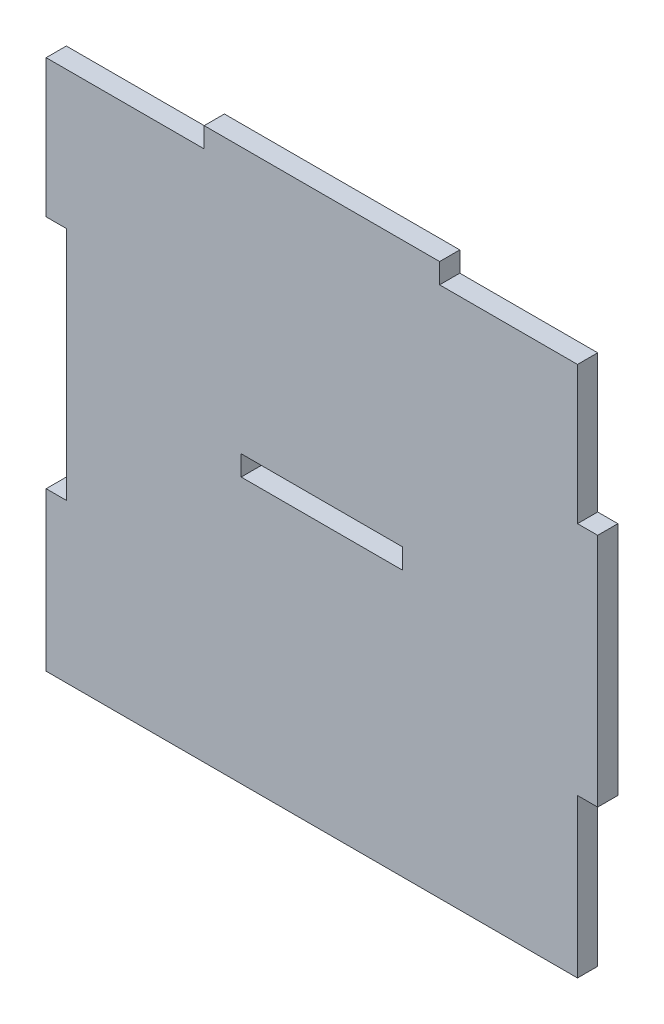
ISO-10303-21;
HEADER;
FILE_DESCRIPTION(('STEP AP214'),'2;1');
FILE_NAME('part.step','',(''),(''),'','','');
FILE_SCHEMA(('AUTOMOTIVE_DESIGN { 1 0 10303 214 1 1 1 1 }'));
ENDSEC;
DATA;
#1=APPLICATION_CONTEXT('core data for automotive mechanical design processes');
#2=APPLICATION_PROTOCOL_DEFINITION('international standard','automotive_design',2000,#1);
#3=PRODUCT_CONTEXT('',#1,'mechanical');
#4=PRODUCT('Part','Part','',(#3));
#5=PRODUCT_RELATED_PRODUCT_CATEGORY('part','',(#4));
#6=PRODUCT_DEFINITION_FORMATION('','',#4);
#7=PRODUCT_DEFINITION_CONTEXT('part definition',#1,'design');
#8=PRODUCT_DEFINITION('design','',#6,#7);
#9=PRODUCT_DEFINITION_SHAPE('','',#8);
#10=(LENGTH_UNIT() NAMED_UNIT(*) SI_UNIT(.MILLI.,.METRE.));
#11=(NAMED_UNIT(*) PLANE_ANGLE_UNIT() SI_UNIT($,.RADIAN.));
#12=(NAMED_UNIT(*) SI_UNIT($,.STERADIAN.) SOLID_ANGLE_UNIT());
#13=UNCERTAINTY_MEASURE_WITH_UNIT(LENGTH_MEASURE(1.E-05),#10,'distance_accuracy_value','');
#14=(GEOMETRIC_REPRESENTATION_CONTEXT(3) GLOBAL_UNCERTAINTY_ASSIGNED_CONTEXT((#13)) GLOBAL_UNIT_ASSIGNED_CONTEXT((#10,
#11,#12)) REPRESENTATION_CONTEXT('',''));
#15=CARTESIAN_POINT('',(0.,0.,0.));
#16=DIRECTION('',(0.,0.,1.));
#17=DIRECTION('',(1.,0.,0.));
#18=AXIS2_PLACEMENT_3D('',#15,#16,#17);
#19=CARTESIAN_POINT('',(38.,-16.,3.));
#20=DIRECTION('',(0.,1.,0.));
#21=DIRECTION('',(-1.,0.,0.));
#22=AXIS2_PLACEMENT_3D('',#19,#20,#21);
#23=PLANE('',#22);
#24=DIRECTION('',(1.,0.,0.));
#25=VECTOR('',#24,1.);
#26=CARTESIAN_POINT('',(38.,-16.,0.));
#27=LINE('',#26,#25);
#28=CARTESIAN_POINT('',(38.,-16.,0.));
#29=VERTEX_POINT('',#28);
#30=CARTESIAN_POINT('',(41.,-16.,0.));
#31=VERTEX_POINT('',#30);
#32=EDGE_CURVE('E218',#29,#31,#27,.T.);
#33=ORIENTED_EDGE('',*,*,#32,.T.);
#34=DIRECTION('',(0.,0.,-1.));
#35=VECTOR('',#34,1.);
#36=CARTESIAN_POINT('',(41.,-16.,3.));
#37=LINE('',#36,#35);
#38=CARTESIAN_POINT('',(41.,-16.,3.));
#39=VERTEX_POINT('',#38);
#40=EDGE_CURVE('E11',#39,#31,#37,.T.);
#41=ORIENTED_EDGE('',*,*,#40,.F.);
#42=DIRECTION('',(1.,0.,0.));
#43=VECTOR('',#42,1.);
#44=CARTESIAN_POINT('',(38.,-16.,3.));
#45=LINE('',#44,#43);
#46=CARTESIAN_POINT('',(38.,-16.,3.));
#47=VERTEX_POINT('',#46);
#48=EDGE_CURVE('E224',#47,#39,#45,.T.);
#49=ORIENTED_EDGE('',*,*,#48,.F.);
#50=DIRECTION('',(0.,0.,-1.));
#51=VECTOR('',#50,1.);
#52=CARTESIAN_POINT('',(38.,-16.,3.));
#53=LINE('',#52,#51);
#54=EDGE_CURVE('E274',#47,#29,#53,.T.);
#55=ORIENTED_EDGE('',*,*,#54,.T.);
#56=EDGE_LOOP('',(#33,#41,#49,#55));
#57=FACE_BOUND('',#56,.T.);
#58=ADVANCED_FACE('F38',(#57),#23,.F.);
#59=CARTESIAN_POINT('',(41.,16.,3.));
#60=DIRECTION('',(-1.,0.,0.));
#61=DIRECTION('',(0.,0.,1.));
#62=AXIS2_PLACEMENT_3D('',#59,#60,#61);
#63=PLANE('',#62);
#64=DIRECTION('',(0.,1.,0.));
#65=VECTOR('',#64,1.);
#66=CARTESIAN_POINT('',(41.,16.,0.));
#67=LINE('',#66,#65);
#68=CARTESIAN_POINT('',(41.,19.,0.));
#69=VERTEX_POINT('',#68);
#70=EDGE_CURVE('E278',#31,#69,#67,.T.);
#71=ORIENTED_EDGE('',*,*,#70,.T.);
#72=DIRECTION('',(0.,0.,-1.));
#73=VECTOR('',#72,1.);
#74=CARTESIAN_POINT('',(41.,19.,3.));
#75=LINE('',#74,#73);
#76=CARTESIAN_POINT('',(41.,19.,3.));
#77=VERTEX_POINT('',#76);
#78=EDGE_CURVE('E46',#77,#69,#75,.T.);
#79=ORIENTED_EDGE('',*,*,#78,.F.);
#80=DIRECTION('',(0.,1.,0.));
#81=VECTOR('',#80,1.);
#82=CARTESIAN_POINT('',(41.,16.,3.));
#83=LINE('',#82,#81);
#84=EDGE_CURVE('E228',#39,#77,#83,.T.);
#85=ORIENTED_EDGE('',*,*,#84,.F.);
#86=ORIENTED_EDGE('',*,*,#40,.T.);
#87=EDGE_LOOP('',(#71,#79,#85,#86));
#88=FACE_BOUND('',#87,.T.);
#89=ADVANCED_FACE('F407',(#88),#63,.F.);
#90=CARTESIAN_POINT('',(41.,19.,3.));
#91=DIRECTION('',(0.,-1.,0.));
#92=DIRECTION('',(0.,0.,-1.));
#93=AXIS2_PLACEMENT_3D('',#90,#91,#92);
#94=PLANE('',#93);
#95=DIRECTION('',(-1.,0.,0.));
#96=VECTOR('',#95,1.);
#97=CARTESIAN_POINT('',(41.,19.,0.));
#98=LINE('',#97,#96);
#99=CARTESIAN_POINT('',(38.,19.,0.));
#100=VERTEX_POINT('',#99);
#101=EDGE_CURVE('E281',#69,#100,#98,.T.);
#102=ORIENTED_EDGE('',*,*,#101,.T.);
#103=DIRECTION('',(0.,0.,-1.));
#104=VECTOR('',#103,1.);
#105=CARTESIAN_POINT('',(38.,19.,3.));
#106=LINE('',#105,#104);
#107=CARTESIAN_POINT('',(38.,19.,3.));
#108=VERTEX_POINT('',#107);
#109=EDGE_CURVE('E377',#108,#100,#106,.T.);
#110=ORIENTED_EDGE('',*,*,#109,.F.);
#111=DIRECTION('',(-1.,0.,0.));
#112=VECTOR('',#111,1.);
#113=CARTESIAN_POINT('',(41.,19.,3.));
#114=LINE('',#113,#112);
#115=EDGE_CURVE('E232',#77,#108,#114,.T.);
#116=ORIENTED_EDGE('',*,*,#115,.F.);
#117=ORIENTED_EDGE('',*,*,#78,.T.);
#118=EDGE_LOOP('',(#102,#110,#116,#117));
#119=FACE_BOUND('',#118,.T.);
#120=ADVANCED_FACE('F386',(#119),#94,.F.);
#121=CARTESIAN_POINT('',(38.,39.5,3.));
#122=DIRECTION('',(-1.,0.,0.));
#123=DIRECTION('',(0.,-1.,0.));
#124=AXIS2_PLACEMENT_3D('',#121,#122,#123);
#125=PLANE('',#124);
#126=DIRECTION('',(0.,1.,0.));
#127=VECTOR('',#126,1.);
#128=CARTESIAN_POINT('',(38.,39.5,0.));
#129=LINE('',#128,#127);
#130=CARTESIAN_POINT('',(38.,39.5,0.));
#131=VERTEX_POINT('',#130);
#132=EDGE_CURVE('E284',#100,#131,#129,.T.);
#133=ORIENTED_EDGE('',*,*,#132,.T.);
#134=DIRECTION('',(0.,0.,-1.));
#135=VECTOR('',#134,1.);
#136=CARTESIAN_POINT('',(38.,39.5,3.));
#137=LINE('',#136,#135);
#138=CARTESIAN_POINT('',(38.,39.5,3.));
#139=VERTEX_POINT('',#138);
#140=EDGE_CURVE('E373',#139,#131,#137,.T.);
#141=ORIENTED_EDGE('',*,*,#140,.F.);
#142=DIRECTION('',(0.,1.,0.));
#143=VECTOR('',#142,1.);
#144=CARTESIAN_POINT('',(38.,39.5,3.));
#145=LINE('',#144,#143);
#146=EDGE_CURVE('E235',#108,#139,#145,.T.);
#147=ORIENTED_EDGE('',*,*,#146,.F.);
#148=ORIENTED_EDGE('',*,*,#109,.T.);
#149=EDGE_LOOP('',(#133,#141,#147,#148));
#150=FACE_BOUND('',#149,.T.);
#151=ADVANCED_FACE('F395',(#150),#125,.F.);
#152=CARTESIAN_POINT('',(17.5,39.5,3.));
#153=DIRECTION('',(0.,-1.,0.));
#154=DIRECTION('',(1.,0.,0.));
#155=AXIS2_PLACEMENT_3D('',#152,#153,#154);
#156=PLANE('',#155);
#157=DIRECTION('',(-1.,0.,0.));
#158=VECTOR('',#157,1.);
#159=CARTESIAN_POINT('',(17.5,39.5,0.));
#160=LINE('',#159,#158);
#161=CARTESIAN_POINT('',(17.5,39.5,0.));
#162=VERTEX_POINT('',#161);
#163=EDGE_CURVE('E287',#131,#162,#160,.T.);
#164=ORIENTED_EDGE('',*,*,#163,.T.);
#165=DIRECTION('',(0.,0.,-1.));
#166=VECTOR('',#165,1.);
#167=CARTESIAN_POINT('',(17.5,39.5,3.));
#168=LINE('',#167,#166);
#169=CARTESIAN_POINT('',(17.5,39.5,3.));
#170=VERTEX_POINT('',#169);
#171=EDGE_CURVE('E369',#170,#162,#168,.T.);
#172=ORIENTED_EDGE('',*,*,#171,.F.);
#173=DIRECTION('',(-1.,0.,0.));
#174=VECTOR('',#173,1.);
#175=CARTESIAN_POINT('',(17.5,39.5,3.));
#176=LINE('',#175,#174);
#177=EDGE_CURVE('E238',#139,#170,#176,.T.);
#178=ORIENTED_EDGE('',*,*,#177,.F.);
#179=ORIENTED_EDGE('',*,*,#140,.T.);
#180=EDGE_LOOP('',(#164,#172,#178,#179));
#181=FACE_BOUND('',#180,.T.);
#182=ADVANCED_FACE('F399',(#181),#156,.F.);
#183=CARTESIAN_POINT('',(17.5,42.5,3.));
#184=DIRECTION('',(-1.,0.,0.));
#185=DIRECTION('',(0.,-1.,0.));
#186=AXIS2_PLACEMENT_3D('',#183,#184,#185);
#187=PLANE('',#186);
#188=DIRECTION('',(0.,1.,0.));
#189=VECTOR('',#188,1.);
#190=CARTESIAN_POINT('',(17.5,42.5,0.));
#191=LINE('',#190,#189);
#192=CARTESIAN_POINT('',(17.5,42.5,0.));
#193=VERTEX_POINT('',#192);
#194=EDGE_CURVE('E290',#162,#193,#191,.T.);
#195=ORIENTED_EDGE('',*,*,#194,.T.);
#196=DIRECTION('',(0.,0.,-1.));
#197=VECTOR('',#196,1.);
#198=CARTESIAN_POINT('',(17.5,42.5,3.));
#199=LINE('',#198,#197);
#200=CARTESIAN_POINT('',(17.5,42.5,3.));
#201=VERTEX_POINT('',#200);
#202=EDGE_CURVE('E365',#201,#193,#199,.T.);
#203=ORIENTED_EDGE('',*,*,#202,.F.);
#204=DIRECTION('',(0.,1.,0.));
#205=VECTOR('',#204,1.);
#206=CARTESIAN_POINT('',(17.5,42.5,3.));
#207=LINE('',#206,#205);
#208=EDGE_CURVE('E241',#170,#201,#207,.T.);
#209=ORIENTED_EDGE('',*,*,#208,.F.);
#210=ORIENTED_EDGE('',*,*,#171,.T.);
#211=EDGE_LOOP('',(#195,#203,#209,#210));
#212=FACE_BOUND('',#211,.T.);
#213=ADVANCED_FACE('F456',(#212),#187,.F.);
#214=CARTESIAN_POINT('',(-17.5,42.5,3.));
#215=DIRECTION('',(0.,-1.,0.));
#216=DIRECTION('',(0.,0.,-1.));
#217=AXIS2_PLACEMENT_3D('',#214,#215,#216);
#218=PLANE('',#217);
#219=DIRECTION('',(-1.,0.,0.));
#220=VECTOR('',#219,1.);
#221=CARTESIAN_POINT('',(-17.5,42.5,0.));
#222=LINE('',#221,#220);
#223=CARTESIAN_POINT('',(-17.5,42.5,0.));
#224=VERTEX_POINT('',#223);
#225=EDGE_CURVE('E293',#193,#224,#222,.T.);
#226=ORIENTED_EDGE('',*,*,#225,.T.);
#227=DIRECTION('',(0.,0.,-1.));
#228=VECTOR('',#227,1.);
#229=CARTESIAN_POINT('',(-17.5,42.5,3.));
#230=LINE('',#229,#228);
#231=CARTESIAN_POINT('',(-17.5,42.5,3.));
#232=VERTEX_POINT('',#231);
#233=EDGE_CURVE('E361',#232,#224,#230,.T.);
#234=ORIENTED_EDGE('',*,*,#233,.F.);
#235=DIRECTION('',(-1.,0.,0.));
#236=VECTOR('',#235,1.);
#237=CARTESIAN_POINT('',(-17.5,42.5,3.));
#238=LINE('',#237,#236);
#239=EDGE_CURVE('E244',#201,#232,#238,.T.);
#240=ORIENTED_EDGE('',*,*,#239,.F.);
#241=ORIENTED_EDGE('',*,*,#202,.T.);
#242=EDGE_LOOP('',(#226,#234,#240,#241));
#243=FACE_BOUND('',#242,.T.);
#244=ADVANCED_FACE('F454',(#243),#218,.F.);
#245=CARTESIAN_POINT('',(-17.5,39.5,3.));
#246=DIRECTION('',(1.,0.,0.));
#247=DIRECTION('',(0.,0.,-1.));
#248=AXIS2_PLACEMENT_3D('',#245,#246,#247);
#249=PLANE('',#248);
#250=DIRECTION('',(0.,-1.,0.));
#251=VECTOR('',#250,1.);
#252=CARTESIAN_POINT('',(-17.5,39.5,0.));
#253=LINE('',#252,#251);
#254=CARTESIAN_POINT('',(-17.5,39.5,0.));
#255=VERTEX_POINT('',#254);
#256=EDGE_CURVE('E296',#224,#255,#253,.T.);
#257=ORIENTED_EDGE('',*,*,#256,.T.);
#258=DIRECTION('',(0.,0.,-1.));
#259=VECTOR('',#258,1.);
#260=CARTESIAN_POINT('',(-17.5,39.5,3.));
#261=LINE('',#260,#259);
#262=CARTESIAN_POINT('',(-17.5,39.5,3.));
#263=VERTEX_POINT('',#262);
#264=EDGE_CURVE('E357',#263,#255,#261,.T.);
#265=ORIENTED_EDGE('',*,*,#264,.F.);
#266=DIRECTION('',(0.,-1.,0.));
#267=VECTOR('',#266,1.);
#268=CARTESIAN_POINT('',(-17.5,39.5,3.));
#269=LINE('',#268,#267);
#270=EDGE_CURVE('E247',#232,#263,#269,.T.);
#271=ORIENTED_EDGE('',*,*,#270,.F.);
#272=ORIENTED_EDGE('',*,*,#233,.T.);
#273=EDGE_LOOP('',(#257,#265,#271,#272));
#274=FACE_BOUND('',#273,.T.);
#275=ADVANCED_FACE('F447',(#274),#249,.F.);
#276=CARTESIAN_POINT('',(-41.,39.5,3.));
#277=DIRECTION('',(0.,-1.,0.));
#278=DIRECTION('',(0.,0.,-1.));
#279=AXIS2_PLACEMENT_3D('',#276,#277,#278);
#280=PLANE('',#279);
#281=DIRECTION('',(-1.,0.,0.));
#282=VECTOR('',#281,1.);
#283=CARTESIAN_POINT('',(-41.,39.5,0.));
#284=LINE('',#283,#282);
#285=CARTESIAN_POINT('',(-41.,39.5,0.));
#286=VERTEX_POINT('',#285);
#287=EDGE_CURVE('E300',#255,#286,#284,.T.);
#288=ORIENTED_EDGE('',*,*,#287,.T.);
#289=DIRECTION('',(0.,0.,-1.));
#290=VECTOR('',#289,1.);
#291=CARTESIAN_POINT('',(-41.,39.5,3.));
#292=LINE('',#291,#290);
#293=CARTESIAN_POINT('',(-41.,39.5,3.));
#294=VERTEX_POINT('',#293);
#295=EDGE_CURVE('E353',#294,#286,#292,.T.);
#296=ORIENTED_EDGE('',*,*,#295,.F.);
#297=DIRECTION('',(-1.,0.,0.));
#298=VECTOR('',#297,1.);
#299=CARTESIAN_POINT('',(-38.,39.5,3.));
#300=LINE('',#299,#298);
#301=EDGE_CURVE('E250',#263,#294,#300,.T.);
#302=ORIENTED_EDGE('',*,*,#301,.F.);
#303=ORIENTED_EDGE('',*,*,#264,.T.);
#304=EDGE_LOOP('',(#288,#296,#302,#303));
#305=FACE_BOUND('',#304,.T.);
#306=ADVANCED_FACE('F451',(#305),#280,.F.);
#307=CARTESIAN_POINT('',(-41.,19.,3.));
#308=DIRECTION('',(1.,0.,0.));
#309=DIRECTION('',(0.,1.,0.));
#310=AXIS2_PLACEMENT_3D('',#307,#308,#309);
#311=PLANE('',#310);
#312=DIRECTION('',(0.,-1.,0.));
#313=VECTOR('',#312,1.);
#314=CARTESIAN_POINT('',(-41.,19.,0.));
#315=LINE('',#314,#313);
#316=CARTESIAN_POINT('',(-41.,19.,0.));
#317=VERTEX_POINT('',#316);
#318=EDGE_CURVE('E303',#286,#317,#315,.T.);
#319=ORIENTED_EDGE('',*,*,#318,.T.);
#320=DIRECTION('',(0.,0.,-1.));
#321=VECTOR('',#320,1.);
#322=CARTESIAN_POINT('',(-41.,19.,3.));
#323=LINE('',#322,#321);
#324=CARTESIAN_POINT('',(-41.,19.,3.));
#325=VERTEX_POINT('',#324);
#326=EDGE_CURVE('E349',#325,#317,#323,.T.);
#327=ORIENTED_EDGE('',*,*,#326,.F.);
#328=DIRECTION('',(0.,-1.,0.));
#329=VECTOR('',#328,1.);
#330=CARTESIAN_POINT('',(-41.,19.,3.));
#331=LINE('',#330,#329);
#332=EDGE_CURVE('E253',#294,#325,#331,.T.);
#333=ORIENTED_EDGE('',*,*,#332,.F.);
#334=ORIENTED_EDGE('',*,*,#295,.T.);
#335=EDGE_LOOP('',(#319,#327,#333,#334));
#336=FACE_BOUND('',#335,.T.);
#337=ADVANCED_FACE('F440',(#336),#311,.F.);
#338=CARTESIAN_POINT('',(-38.,19.,3.));
#339=DIRECTION('',(0.,1.,0.));
#340=DIRECTION('',(-1.,0.,0.));
#341=AXIS2_PLACEMENT_3D('',#338,#339,#340);
#342=PLANE('',#341);
#343=DIRECTION('',(1.,0.,0.));
#344=VECTOR('',#343,1.);
#345=CARTESIAN_POINT('',(-38.,19.,0.));
#346=LINE('',#345,#344);
#347=CARTESIAN_POINT('',(-38.,19.,0.));
#348=VERTEX_POINT('',#347);
#349=EDGE_CURVE('E306',#317,#348,#346,.T.);
#350=ORIENTED_EDGE('',*,*,#349,.T.);
#351=DIRECTION('',(0.,0.,-1.));
#352=VECTOR('',#351,1.);
#353=CARTESIAN_POINT('',(-38.,19.,3.));
#354=LINE('',#353,#352);
#355=CARTESIAN_POINT('',(-38.,19.,3.));
#356=VERTEX_POINT('',#355);
#357=EDGE_CURVE('E345',#356,#348,#354,.T.);
#358=ORIENTED_EDGE('',*,*,#357,.F.);
#359=DIRECTION('',(1.,0.,0.));
#360=VECTOR('',#359,1.);
#361=CARTESIAN_POINT('',(-38.,19.,3.));
#362=LINE('',#361,#360);
#363=EDGE_CURVE('E256',#325,#356,#362,.T.);
#364=ORIENTED_EDGE('',*,*,#363,.F.);
#365=ORIENTED_EDGE('',*,*,#326,.T.);
#366=EDGE_LOOP('',(#350,#358,#364,#365));
#367=FACE_BOUND('',#366,.T.);
#368=ADVANCED_FACE('F435',(#367),#342,.F.);
#369=CARTESIAN_POINT('',(-38.,16.,3.));
#370=DIRECTION('',(1.,0.,0.));
#371=DIRECTION('',(0.,0.,-1.));
#372=AXIS2_PLACEMENT_3D('',#369,#370,#371);
#373=PLANE('',#372);
#374=DIRECTION('',(0.,-1.,0.));
#375=VECTOR('',#374,1.);
#376=CARTESIAN_POINT('',(-38.,16.,0.));
#377=LINE('',#376,#375);
#378=CARTESIAN_POINT('',(-38.,-16.,0.));
#379=VERTEX_POINT('',#378);
#380=EDGE_CURVE('E310',#348,#379,#377,.T.);
#381=ORIENTED_EDGE('',*,*,#380,.T.);
#382=DIRECTION('',(0.,0.,-1.));
#383=VECTOR('',#382,1.);
#384=CARTESIAN_POINT('',(-38.,-16.,3.));
#385=LINE('',#384,#383);
#386=CARTESIAN_POINT('',(-38.,-16.,3.));
#387=VERTEX_POINT('',#386);
#388=EDGE_CURVE('E341',#387,#379,#385,.T.);
#389=ORIENTED_EDGE('',*,*,#388,.F.);
#390=DIRECTION('',(0.,-1.,0.));
#391=VECTOR('',#390,1.);
#392=CARTESIAN_POINT('',(-38.,16.,3.));
#393=LINE('',#392,#391);
#394=EDGE_CURVE('E259',#356,#387,#393,.T.);
#395=ORIENTED_EDGE('',*,*,#394,.F.);
#396=ORIENTED_EDGE('',*,*,#357,.T.);
#397=EDGE_LOOP('',(#381,#389,#395,#396));
#398=FACE_BOUND('',#397,.T.);
#399=ADVANCED_FACE('F430',(#398),#373,.F.);
#400=CARTESIAN_POINT('',(-41.,-16.,3.));
#401=DIRECTION('',(0.,-1.,0.));
#402=DIRECTION('',(0.,0.,-1.));
#403=AXIS2_PLACEMENT_3D('',#400,#401,#402);
#404=PLANE('',#403);
#405=DIRECTION('',(-1.,0.,0.));
#406=VECTOR('',#405,1.);
#407=CARTESIAN_POINT('',(-41.,-16.,0.));
#408=LINE('',#407,#406);
#409=CARTESIAN_POINT('',(-41.,-16.,0.));
#410=VERTEX_POINT('',#409);
#411=EDGE_CURVE('E313',#379,#410,#408,.T.);
#412=ORIENTED_EDGE('',*,*,#411,.T.);
#413=DIRECTION('',(0.,0.,-1.));
#414=VECTOR('',#413,1.);
#415=CARTESIAN_POINT('',(-41.,-16.,3.));
#416=LINE('',#415,#414);
#417=CARTESIAN_POINT('',(-41.,-16.,3.));
#418=VERTEX_POINT('',#417);
#419=EDGE_CURVE('E337',#418,#410,#416,.T.);
#420=ORIENTED_EDGE('',*,*,#419,.F.);
#421=DIRECTION('',(-1.,0.,0.));
#422=VECTOR('',#421,1.);
#423=CARTESIAN_POINT('',(-41.,-16.,3.));
#424=LINE('',#423,#422);
#425=EDGE_CURVE('E262',#387,#418,#424,.T.);
#426=ORIENTED_EDGE('',*,*,#425,.F.);
#427=ORIENTED_EDGE('',*,*,#388,.T.);
#428=EDGE_LOOP('',(#412,#420,#426,#427));
#429=FACE_BOUND('',#428,.T.);
#430=ADVANCED_FACE('F426',(#429),#404,.F.);
#431=CARTESIAN_POINT('',(-41.,-19.,3.));
#432=DIRECTION('',(1.,0.,0.));
#433=DIRECTION('',(0.,1.,0.));
#434=AXIS2_PLACEMENT_3D('',#431,#432,#433);
#435=PLANE('',#434);
#436=DIRECTION('',(0.,-1.,0.));
#437=VECTOR('',#436,1.);
#438=CARTESIAN_POINT('',(-41.,-19.,0.));
#439=LINE('',#438,#437);
#440=CARTESIAN_POINT('',(-41.,-39.5,0.));
#441=VERTEX_POINT('',#440);
#442=EDGE_CURVE('E317',#410,#441,#439,.T.);
#443=ORIENTED_EDGE('',*,*,#442,.T.);
#444=DIRECTION('',(0.,0.,-1.));
#445=VECTOR('',#444,1.);
#446=CARTESIAN_POINT('',(-41.,-39.5,3.));
#447=LINE('',#446,#445);
#448=CARTESIAN_POINT('',(-41.,-39.5,3.));
#449=VERTEX_POINT('',#448);
#450=EDGE_CURVE('E333',#449,#441,#447,.T.);
#451=ORIENTED_EDGE('',*,*,#450,.F.);
#452=DIRECTION('',(0.,-1.,0.));
#453=VECTOR('',#452,1.);
#454=CARTESIAN_POINT('',(-41.,-19.,3.));
#455=LINE('',#454,#453);
#456=EDGE_CURVE('E265',#418,#449,#455,.T.);
#457=ORIENTED_EDGE('',*,*,#456,.F.);
#458=ORIENTED_EDGE('',*,*,#419,.T.);
#459=EDGE_LOOP('',(#443,#451,#457,#458));
#460=FACE_BOUND('',#459,.T.);
#461=ADVANCED_FACE('F423',(#460),#435,.F.);
#462=CARTESIAN_POINT('',(-41.,-39.5,3.));
#463=DIRECTION('',(0.,1.,0.));
#464=DIRECTION('',(0.,0.,1.));
#465=AXIS2_PLACEMENT_3D('',#462,#463,#464);
#466=PLANE('',#465);
#467=DIRECTION('',(1.,0.,0.));
#468=VECTOR('',#467,1.);
#469=CARTESIAN_POINT('',(-41.,-39.5,0.));
#470=LINE('',#469,#468);
#471=CARTESIAN_POINT('',(38.,-39.5,0.));
#472=VERTEX_POINT('',#471);
#473=EDGE_CURVE('E320',#441,#472,#470,.T.);
#474=ORIENTED_EDGE('',*,*,#473,.T.);
#475=DIRECTION('',(0.,0.,-1.));
#476=VECTOR('',#475,1.);
#477=CARTESIAN_POINT('',(38.,-39.5,3.));
#478=LINE('',#477,#476);
#479=CARTESIAN_POINT('',(38.,-39.5,3.));
#480=VERTEX_POINT('',#479);
#481=EDGE_CURVE('E329',#480,#472,#478,.T.);
#482=ORIENTED_EDGE('',*,*,#481,.F.);
#483=DIRECTION('',(1.,0.,0.));
#484=VECTOR('',#483,1.);
#485=CARTESIAN_POINT('',(-41.,-39.5,3.));
#486=LINE('',#485,#484);
#487=EDGE_CURVE('E268',#449,#480,#486,.T.);
#488=ORIENTED_EDGE('',*,*,#487,.F.);
#489=ORIENTED_EDGE('',*,*,#450,.T.);
#490=EDGE_LOOP('',(#474,#482,#488,#489));
#491=FACE_BOUND('',#490,.T.);
#492=ADVANCED_FACE('F414',(#491),#466,.F.);
#493=CARTESIAN_POINT('',(38.,-19.,3.));
#494=DIRECTION('',(-1.,0.,0.));
#495=DIRECTION('',(0.,-1.,0.));
#496=AXIS2_PLACEMENT_3D('',#493,#494,#495);
#497=PLANE('',#496);
#498=DIRECTION('',(0.,1.,0.));
#499=VECTOR('',#498,1.);
#500=CARTESIAN_POINT('',(38.,-19.,0.));
#501=LINE('',#500,#499);
#502=EDGE_CURVE('E229',#472,#29,#501,.T.);
#503=ORIENTED_EDGE('',*,*,#502,.T.);
#504=ORIENTED_EDGE('',*,*,#54,.F.);
#505=DIRECTION('',(0.,1.,0.));
#506=VECTOR('',#505,1.);
#507=CARTESIAN_POINT('',(38.,-19.,3.));
#508=LINE('',#507,#506);
#509=EDGE_CURVE('E271',#480,#47,#508,.T.);
#510=ORIENTED_EDGE('',*,*,#509,.F.);
#511=ORIENTED_EDGE('',*,*,#481,.T.);
#512=EDGE_LOOP('',(#503,#504,#510,#511));
#513=FACE_BOUND('',#512,.T.);
#514=ADVANCED_FACE('F418',(#513),#497,.F.);
#515=CARTESIAN_POINT('',(0.,0.,3.));
#516=DIRECTION('',(0.,0.,-1.));
#517=DIRECTION('',(-1.,0.,0.));
#518=AXIS2_PLACEMENT_3D('',#515,#516,#517);
#519=PLANE('',#518);
#520=DIRECTION('',(-1.,0.,0.));
#521=VECTOR('',#520,1.);
#522=CARTESIAN_POINT('',(-12.,3.,3.));
#523=LINE('',#522,#521);
#524=CARTESIAN_POINT('',(12.,3.,3.));
#525=VERTEX_POINT('',#524);
#526=CARTESIAN_POINT('',(-12.,3.,3.));
#527=VERTEX_POINT('',#526);
#528=EDGE_CURVE('E209',#525,#527,#523,.T.);
#529=ORIENTED_EDGE('',*,*,#528,.F.);
#530=DIRECTION('',(0.,1.,0.));
#531=VECTOR('',#530,1.);
#532=CARTESIAN_POINT('',(12.,3.,3.));
#533=LINE('',#532,#531);
#534=CARTESIAN_POINT('',(12.,0.,3.));
#535=VERTEX_POINT('',#534);
#536=EDGE_CURVE('E53',#535,#525,#533,.T.);
#537=ORIENTED_EDGE('',*,*,#536,.F.);
#538=DIRECTION('',(1.,0.,0.));
#539=VECTOR('',#538,1.);
#540=CARTESIAN_POINT('',(-12.,0.,3.));
#541=LINE('',#540,#539);
#542=CARTESIAN_POINT('',(-12.,0.,3.));
#543=VERTEX_POINT('',#542);
#544=EDGE_CURVE('E196',#543,#535,#541,.T.);
#545=ORIENTED_EDGE('',*,*,#544,.F.);
#546=DIRECTION('',(0.,-1.,0.));
#547=VECTOR('',#546,1.);
#548=CARTESIAN_POINT('',(-12.,3.,3.));
#549=LINE('',#548,#547);
#550=EDGE_CURVE('E200',#527,#543,#549,.T.);
#551=ORIENTED_EDGE('',*,*,#550,.F.);
#552=EDGE_LOOP('',(#529,#537,#545,#551));
#553=FACE_BOUND('',#552,.T.);
#554=ORIENTED_EDGE('',*,*,#48,.T.);
#555=ORIENTED_EDGE('',*,*,#84,.T.);
#556=ORIENTED_EDGE('',*,*,#115,.T.);
#557=ORIENTED_EDGE('',*,*,#146,.T.);
#558=ORIENTED_EDGE('',*,*,#177,.T.);
#559=ORIENTED_EDGE('',*,*,#208,.T.);
#560=ORIENTED_EDGE('',*,*,#239,.T.);
#561=ORIENTED_EDGE('',*,*,#270,.T.);
#562=ORIENTED_EDGE('',*,*,#301,.T.);
#563=ORIENTED_EDGE('',*,*,#332,.T.);
#564=ORIENTED_EDGE('',*,*,#363,.T.);
#565=ORIENTED_EDGE('',*,*,#394,.T.);
#566=ORIENTED_EDGE('',*,*,#425,.T.);
#567=ORIENTED_EDGE('',*,*,#456,.T.);
#568=ORIENTED_EDGE('',*,*,#487,.T.);
#569=ORIENTED_EDGE('',*,*,#509,.T.);
#570=EDGE_LOOP('',(#554,#555,#556,#557,#558,#559,#560,#561,#562,#563,#564,#565,#566,#567,#568,#569));
#571=FACE_BOUND('',#570,.T.);
#572=ADVANCED_FACE('F403',(#553,#571),#519,.F.);
#573=CARTESIAN_POINT('',(0.,0.,0.));
#574=DIRECTION('',(0.,0.,-1.));
#575=DIRECTION('',(-1.,0.,0.));
#576=AXIS2_PLACEMENT_3D('',#573,#574,#575);
#577=PLANE('',#576);
#578=DIRECTION('',(0.,1.,0.));
#579=VECTOR('',#578,1.);
#580=CARTESIAN_POINT('',(12.,3.,0.));
#581=LINE('',#580,#579);
#582=CARTESIAN_POINT('',(12.,0.,0.));
#583=VERTEX_POINT('',#582);
#584=CARTESIAN_POINT('',(12.,3.,0.));
#585=VERTEX_POINT('',#584);
#586=EDGE_CURVE('E177',#583,#585,#581,.T.);
#587=ORIENTED_EDGE('',*,*,#586,.T.);
#588=DIRECTION('',(-1.,0.,0.));
#589=VECTOR('',#588,1.);
#590=CARTESIAN_POINT('',(-12.,3.,0.));
#591=LINE('',#590,#589);
#592=CARTESIAN_POINT('',(-12.,3.,0.));
#593=VERTEX_POINT('',#592);
#594=EDGE_CURVE('E187',#585,#593,#591,.T.);
#595=ORIENTED_EDGE('',*,*,#594,.T.);
#596=DIRECTION('',(0.,-1.,0.));
#597=VECTOR('',#596,1.);
#598=CARTESIAN_POINT('',(-12.,3.,0.));
#599=LINE('',#598,#597);
#600=CARTESIAN_POINT('',(-12.,0.,0.));
#601=VERTEX_POINT('',#600);
#602=EDGE_CURVE('E61',#593,#601,#599,.T.);
#603=ORIENTED_EDGE('',*,*,#602,.T.);
#604=DIRECTION('',(1.,0.,0.));
#605=VECTOR('',#604,1.);
#606=CARTESIAN_POINT('',(-12.,0.,0.));
#607=LINE('',#606,#605);
#608=EDGE_CURVE('E184',#601,#583,#607,.T.);
#609=ORIENTED_EDGE('',*,*,#608,.T.);
#610=EDGE_LOOP('',(#587,#595,#603,#609));
#611=FACE_BOUND('',#610,.T.);
#612=ORIENTED_EDGE('',*,*,#32,.F.);
#613=ORIENTED_EDGE('',*,*,#502,.F.);
#614=ORIENTED_EDGE('',*,*,#473,.F.);
#615=ORIENTED_EDGE('',*,*,#442,.F.);
#616=ORIENTED_EDGE('',*,*,#411,.F.);
#617=ORIENTED_EDGE('',*,*,#380,.F.);
#618=ORIENTED_EDGE('',*,*,#349,.F.);
#619=ORIENTED_EDGE('',*,*,#318,.F.);
#620=ORIENTED_EDGE('',*,*,#287,.F.);
#621=ORIENTED_EDGE('',*,*,#256,.F.);
#622=ORIENTED_EDGE('',*,*,#225,.F.);
#623=ORIENTED_EDGE('',*,*,#194,.F.);
#624=ORIENTED_EDGE('',*,*,#163,.F.);
#625=ORIENTED_EDGE('',*,*,#132,.F.);
#626=ORIENTED_EDGE('',*,*,#101,.F.);
#627=ORIENTED_EDGE('',*,*,#70,.F.);
#628=EDGE_LOOP('',(#612,#613,#614,#615,#616,#617,#618,#619,#620,#621,#622,#623,#624,#625,#626,#627));
#629=FACE_BOUND('',#628,.T.);
#630=ADVANCED_FACE('F192',(#611,#629),#577,.T.);
#631=CARTESIAN_POINT('',(12.,3.,0.));
#632=DIRECTION('',(1.,0.,0.));
#633=DIRECTION('',(0.,1.,0.));
#634=AXIS2_PLACEMENT_3D('',#631,#632,#633);
#635=PLANE('',#634);
#636=ORIENTED_EDGE('',*,*,#536,.T.);
#637=DIRECTION('',(0.,0.,1.));
#638=VECTOR('',#637,1.);
#639=CARTESIAN_POINT('',(12.,3.,0.));
#640=LINE('',#639,#638);
#641=EDGE_CURVE('E173',#585,#525,#640,.T.);
#642=ORIENTED_EDGE('',*,*,#641,.F.);
#643=ORIENTED_EDGE('',*,*,#586,.F.);
#644=DIRECTION('',(0.,0.,1.));
#645=VECTOR('',#644,1.);
#646=CARTESIAN_POINT('',(12.,0.,0.));
#647=LINE('',#646,#645);
#648=EDGE_CURVE('E215',#583,#535,#647,.T.);
#649=ORIENTED_EDGE('',*,*,#648,.T.);
#650=EDGE_LOOP('',(#636,#642,#643,#649));
#651=FACE_BOUND('',#650,.T.);
#652=ADVANCED_FACE('F175',(#651),#635,.F.);
#653=CARTESIAN_POINT('',(-12.,0.,0.));
#654=DIRECTION('',(0.,-1.,0.));
#655=DIRECTION('',(0.,0.,-1.));
#656=AXIS2_PLACEMENT_3D('',#653,#654,#655);
#657=PLANE('',#656);
#658=ORIENTED_EDGE('',*,*,#544,.T.);
#659=ORIENTED_EDGE('',*,*,#648,.F.);
#660=ORIENTED_EDGE('',*,*,#608,.F.);
#661=DIRECTION('',(0.,0.,1.));
#662=VECTOR('',#661,1.);
#663=CARTESIAN_POINT('',(-12.,0.,0.));
#664=LINE('',#663,#662);
#665=EDGE_CURVE('E219',#601,#543,#664,.T.);
#666=ORIENTED_EDGE('',*,*,#665,.T.);
#667=EDGE_LOOP('',(#658,#659,#660,#666));
#668=FACE_BOUND('',#667,.T.);
#669=ADVANCED_FACE('F591',(#668),#657,.F.);
#670=CARTESIAN_POINT('',(-12.,3.,0.));
#671=DIRECTION('',(-1.,0.,0.));
#672=DIRECTION('',(0.,-1.,0.));
#673=AXIS2_PLACEMENT_3D('',#670,#671,#672);
#674=PLANE('',#673);
#675=ORIENTED_EDGE('',*,*,#550,.T.);
#676=ORIENTED_EDGE('',*,*,#665,.F.);
#677=ORIENTED_EDGE('',*,*,#602,.F.);
#678=DIRECTION('',(0.,0.,1.));
#679=VECTOR('',#678,1.);
#680=CARTESIAN_POINT('',(-12.,3.,0.));
#681=LINE('',#680,#679);
#682=EDGE_CURVE('E183',#593,#527,#681,.T.);
#683=ORIENTED_EDGE('',*,*,#682,.T.);
#684=EDGE_LOOP('',(#675,#676,#677,#683));
#685=FACE_BOUND('',#684,.T.);
#686=ADVANCED_FACE('F600',(#685),#674,.F.);
#687=CARTESIAN_POINT('',(-12.,3.,0.));
#688=DIRECTION('',(0.,1.,0.));
#689=DIRECTION('',(0.,0.,1.));
#690=AXIS2_PLACEMENT_3D('',#687,#688,#689);
#691=PLANE('',#690);
#692=ORIENTED_EDGE('',*,*,#528,.T.);
#693=ORIENTED_EDGE('',*,*,#682,.F.);
#694=ORIENTED_EDGE('',*,*,#594,.F.);
#695=ORIENTED_EDGE('',*,*,#641,.T.);
#696=EDGE_LOOP('',(#692,#693,#694,#695));
#697=FACE_BOUND('',#696,.T.);
#698=ADVANCED_FACE('F188',(#697),#691,.F.);
#699=CLOSED_SHELL('',(#58,#89,#120,#151,#182,#213,#244,#275,#306,#337,#368,#399,#430,#461,#492,
#514,#572,#630,#652,#669,#686,#698));
#700=MANIFOLD_SOLID_BREP('B2',#699);
#701=ADVANCED_BREP_SHAPE_REPRESENTATION('',(#18,#700),#14);
#702=SHAPE_DEFINITION_REPRESENTATION(#9,#701);
ENDSEC;
END-ISO-10303-21;
